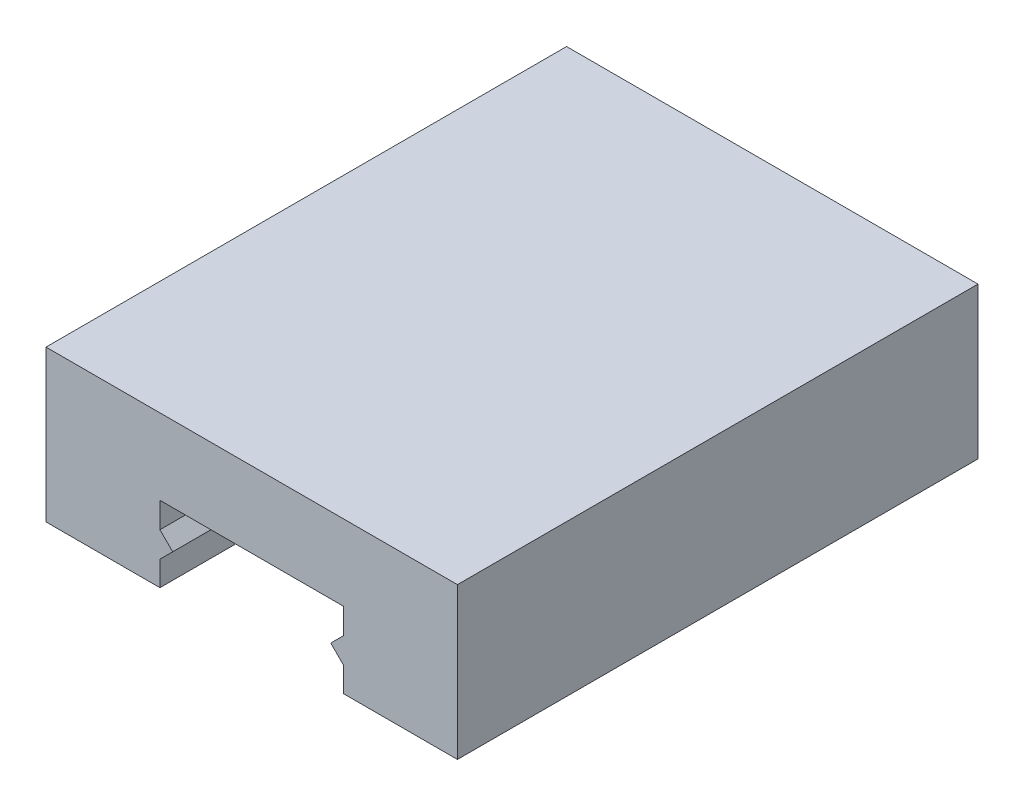
ISO-10303-21;
HEADER;
FILE_DESCRIPTION(('STEP AP214'),'2;1');
FILE_NAME('part.step','',(''),(''),'','','');
FILE_SCHEMA(('AUTOMOTIVE_DESIGN { 1 0 10303 214 1 1 1 1 }'));
ENDSEC;
DATA;
#1=APPLICATION_CONTEXT('core data for automotive mechanical design processes');
#2=APPLICATION_PROTOCOL_DEFINITION('international standard','automotive_design',2000,#1);
#3=PRODUCT_CONTEXT('',#1,'mechanical');
#4=PRODUCT('Part','Part','',(#3));
#5=PRODUCT_RELATED_PRODUCT_CATEGORY('part','',(#4));
#6=PRODUCT_DEFINITION_FORMATION('','',#4);
#7=PRODUCT_DEFINITION_CONTEXT('part definition',#1,'design');
#8=PRODUCT_DEFINITION('design','',#6,#7);
#9=PRODUCT_DEFINITION_SHAPE('','',#8);
#10=(LENGTH_UNIT() NAMED_UNIT(*) SI_UNIT(.MILLI.,.METRE.));
#11=(NAMED_UNIT(*) PLANE_ANGLE_UNIT() SI_UNIT($,.RADIAN.));
#12=(NAMED_UNIT(*) SI_UNIT($,.STERADIAN.) SOLID_ANGLE_UNIT());
#13=UNCERTAINTY_MEASURE_WITH_UNIT(LENGTH_MEASURE(1.E-05),#10,'distance_accuracy_value','');
#14=(GEOMETRIC_REPRESENTATION_CONTEXT(3) GLOBAL_UNCERTAINTY_ASSIGNED_CONTEXT((#13)) GLOBAL_UNIT_ASSIGNED_CONTEXT((#10,
#11,#12)) REPRESENTATION_CONTEXT('',''));
#15=CARTESIAN_POINT('',(0.,0.,0.));
#16=DIRECTION('',(0.,0.,1.));
#17=DIRECTION('',(1.,0.,0.));
#18=AXIS2_PLACEMENT_3D('',#15,#16,#17);
#19=CARTESIAN_POINT('',(-6.,0.05,34.036));
#20=DIRECTION('',(-1.,0.,0.));
#21=DIRECTION('',(0.,0.,1.));
#22=AXIS2_PLACEMENT_3D('',#19,#20,#21);
#23=PLANE('',#22);
#24=DIRECTION('',(0.,1.,0.));
#25=VECTOR('',#24,1.);
#26=CARTESIAN_POINT('',(-6.,0.05,0.));
#27=LINE('',#26,#25);
#28=CARTESIAN_POINT('',(-6.,0.05,0.));
#29=VERTEX_POINT('',#28);
#30=CARTESIAN_POINT('',(-6.,1.66666666666667,0.));
#31=VERTEX_POINT('',#30);
#32=EDGE_CURVE('E205',#29,#31,#27,.T.);
#33=ORIENTED_EDGE('',*,*,#32,.T.);
#34=DIRECTION('',(0.,0.,-1.));
#35=VECTOR('',#34,1.);
#36=CARTESIAN_POINT('',(-6.,1.66666666666667,34.036));
#37=LINE('',#36,#35);
#38=CARTESIAN_POINT('',(-6.,1.66666666666667,34.036));
#39=VERTEX_POINT('',#38);
#40=EDGE_CURVE('E11',#39,#31,#37,.T.);
#41=ORIENTED_EDGE('',*,*,#40,.F.);
#42=DIRECTION('',(0.,1.,0.));
#43=VECTOR('',#42,1.);
#44=CARTESIAN_POINT('',(-6.,0.05,34.036));
#45=LINE('',#44,#43);
#46=CARTESIAN_POINT('',(-6.,0.05,34.036));
#47=VERTEX_POINT('',#46);
#48=EDGE_CURVE('E245',#47,#39,#45,.T.);
#49=ORIENTED_EDGE('',*,*,#48,.F.);
#50=DIRECTION('',(0.,0.,-1.));
#51=VECTOR('',#50,1.);
#52=CARTESIAN_POINT('',(-6.,0.05,34.036));
#53=LINE('',#52,#51);
#54=EDGE_CURVE('E201',#47,#29,#53,.T.);
#55=ORIENTED_EDGE('',*,*,#54,.T.);
#56=EDGE_LOOP('',(#33,#41,#49,#55));
#57=FACE_BOUND('',#56,.T.);
#58=ADVANCED_FACE('F38',(#57),#23,.F.);
#59=CARTESIAN_POINT('',(-6.,1.66666666666667,34.036));
#60=DIRECTION('',(-0.707106781186551,0.707106781186544,0.));
#61=DIRECTION('',(-0.707106781186544,-0.707106781186551,0.));
#62=AXIS2_PLACEMENT_3D('',#59,#60,#61);
#63=PLANE('',#62);
#64=DIRECTION('',(0.707106781186544,0.707106781186551,0.));
#65=VECTOR('',#64,1.);
#66=CARTESIAN_POINT('',(-6.,1.66666666666667,0.));
#67=LINE('',#66,#65);
#68=CARTESIAN_POINT('',(-5.16666666666667,2.5,0.));
#69=VERTEX_POINT('',#68);
#70=EDGE_CURVE('E209',#31,#69,#67,.T.);
#71=ORIENTED_EDGE('',*,*,#70,.T.);
#72=DIRECTION('',(0.,0.,-1.));
#73=VECTOR('',#72,1.);
#74=CARTESIAN_POINT('',(-5.16666666666667,2.5,34.036));
#75=LINE('',#74,#73);
#76=CARTESIAN_POINT('',(-5.16666666666667,2.5,34.036));
#77=VERTEX_POINT('',#76);
#78=EDGE_CURVE('E47',#77,#69,#75,.T.);
#79=ORIENTED_EDGE('',*,*,#78,.F.);
#80=DIRECTION('',(0.707106781186544,0.707106781186551,0.));
#81=VECTOR('',#80,1.);
#82=CARTESIAN_POINT('',(-6.,1.66666666666667,34.036));
#83=LINE('',#82,#81);
#84=EDGE_CURVE('E134',#39,#77,#83,.T.);
#85=ORIENTED_EDGE('',*,*,#84,.F.);
#86=ORIENTED_EDGE('',*,*,#40,.T.);
#87=EDGE_LOOP('',(#71,#79,#85,#86));
#88=FACE_BOUND('',#87,.T.);
#89=ADVANCED_FACE('F351',(#88),#63,.F.);
#90=CARTESIAN_POINT('',(-5.16666666666667,2.5,34.036));
#91=DIRECTION('',(-0.707106781186547,-0.707106781186548,0.));
#92=DIRECTION('',(0.707106781186548,-0.707106781186547,0.));
#93=AXIS2_PLACEMENT_3D('',#90,#91,#92);
#94=PLANE('',#93);
#95=DIRECTION('',(-0.707106781186548,0.707106781186547,0.));
#96=VECTOR('',#95,1.);
#97=CARTESIAN_POINT('',(-5.16666666666667,2.5,0.));
#98=LINE('',#97,#96);
#99=CARTESIAN_POINT('',(-6.,3.33333333333333,0.));
#100=VERTEX_POINT('',#99);
#101=EDGE_CURVE('E212',#69,#100,#98,.T.);
#102=ORIENTED_EDGE('',*,*,#101,.T.);
#103=DIRECTION('',(0.,0.,-1.));
#104=VECTOR('',#103,1.);
#105=CARTESIAN_POINT('',(-6.,3.33333333333333,34.036));
#106=LINE('',#105,#104);
#107=CARTESIAN_POINT('',(-6.,3.33333333333333,34.036));
#108=VERTEX_POINT('',#107);
#109=EDGE_CURVE('E279',#108,#100,#106,.T.);
#110=ORIENTED_EDGE('',*,*,#109,.F.);
#111=DIRECTION('',(-0.707106781186548,0.707106781186547,0.));
#112=VECTOR('',#111,1.);
#113=CARTESIAN_POINT('',(-5.16666666666667,2.5,34.036));
#114=LINE('',#113,#112);
#115=EDGE_CURVE('E288',#77,#108,#114,.T.);
#116=ORIENTED_EDGE('',*,*,#115,.F.);
#117=ORIENTED_EDGE('',*,*,#78,.T.);
#118=EDGE_LOOP('',(#102,#110,#116,#117));
#119=FACE_BOUND('',#118,.T.);
#120=ADVANCED_FACE('F286',(#119),#94,.F.);
#121=CARTESIAN_POINT('',(-6.,3.33333333333333,34.036));
#122=DIRECTION('',(-1.,0.,0.));
#123=DIRECTION('',(0.,0.,1.));
#124=AXIS2_PLACEMENT_3D('',#121,#122,#123);
#125=PLANE('',#124);
#126=DIRECTION('',(0.,1.,0.));
#127=VECTOR('',#126,1.);
#128=CARTESIAN_POINT('',(-6.,3.33333333333333,0.));
#129=LINE('',#128,#127);
#130=CARTESIAN_POINT('',(-6.,5.,0.));
#131=VERTEX_POINT('',#130);
#132=EDGE_CURVE('E215',#100,#131,#129,.T.);
#133=ORIENTED_EDGE('',*,*,#132,.T.);
#134=DIRECTION('',(0.,0.,-1.));
#135=VECTOR('',#134,1.);
#136=CARTESIAN_POINT('',(-6.,5.,34.036));
#137=LINE('',#136,#135);
#138=CARTESIAN_POINT('',(-6.,5.,34.036));
#139=VERTEX_POINT('',#138);
#140=EDGE_CURVE('E275',#139,#131,#137,.T.);
#141=ORIENTED_EDGE('',*,*,#140,.F.);
#142=DIRECTION('',(0.,1.,0.));
#143=VECTOR('',#142,1.);
#144=CARTESIAN_POINT('',(-6.,3.33333333333333,34.036));
#145=LINE('',#144,#143);
#146=EDGE_CURVE('E307',#108,#139,#145,.T.);
#147=ORIENTED_EDGE('',*,*,#146,.F.);
#148=ORIENTED_EDGE('',*,*,#109,.T.);
#149=EDGE_LOOP('',(#133,#141,#147,#148));
#150=FACE_BOUND('',#149,.T.);
#151=ADVANCED_FACE('F297',(#150),#125,.F.);
#152=CARTESIAN_POINT('',(-6.,5.,34.036));
#153=DIRECTION('',(0.,1.,0.));
#154=DIRECTION('',(0.,0.,1.));
#155=AXIS2_PLACEMENT_3D('',#152,#153,#154);
#156=PLANE('',#155);
#157=DIRECTION('',(1.,0.,0.));
#158=VECTOR('',#157,1.);
#159=CARTESIAN_POINT('',(-6.,5.,0.));
#160=LINE('',#159,#158);
#161=CARTESIAN_POINT('',(6.,5.,0.));
#162=VERTEX_POINT('',#161);
#163=EDGE_CURVE('E218',#131,#162,#160,.T.);
#164=ORIENTED_EDGE('',*,*,#163,.T.);
#165=DIRECTION('',(0.,0.,-1.));
#166=VECTOR('',#165,1.);
#167=CARTESIAN_POINT('',(6.,5.,34.036));
#168=LINE('',#167,#166);
#169=CARTESIAN_POINT('',(6.,5.,34.036));
#170=VERTEX_POINT('',#169);
#171=EDGE_CURVE('E271',#170,#162,#168,.T.);
#172=ORIENTED_EDGE('',*,*,#171,.F.);
#173=DIRECTION('',(1.,0.,0.));
#174=VECTOR('',#173,1.);
#175=CARTESIAN_POINT('',(-6.,5.,34.036));
#176=LINE('',#175,#174);
#177=EDGE_CURVE('E303',#139,#170,#176,.T.);
#178=ORIENTED_EDGE('',*,*,#177,.F.);
#179=ORIENTED_EDGE('',*,*,#140,.T.);
#180=EDGE_LOOP('',(#164,#172,#178,#179));
#181=FACE_BOUND('',#180,.T.);
#182=ADVANCED_FACE('F301',(#181),#156,.F.);
#183=CARTESIAN_POINT('',(6.,5.,34.036));
#184=DIRECTION('',(1.,0.,0.));
#185=DIRECTION('',(0.,0.,-1.));
#186=AXIS2_PLACEMENT_3D('',#183,#184,#185);
#187=PLANE('',#186);
#188=DIRECTION('',(0.,-1.,0.));
#189=VECTOR('',#188,1.);
#190=CARTESIAN_POINT('',(6.,5.,0.));
#191=LINE('',#190,#189);
#192=CARTESIAN_POINT('',(6.,3.33333333333333,0.));
#193=VERTEX_POINT('',#192);
#194=EDGE_CURVE('E221',#162,#193,#191,.T.);
#195=ORIENTED_EDGE('',*,*,#194,.T.);
#196=DIRECTION('',(0.,0.,-1.));
#197=VECTOR('',#196,1.);
#198=CARTESIAN_POINT('',(6.,3.33333333333333,34.036));
#199=LINE('',#198,#197);
#200=CARTESIAN_POINT('',(6.,3.33333333333333,34.036));
#201=VERTEX_POINT('',#200);
#202=EDGE_CURVE('E267',#201,#193,#199,.T.);
#203=ORIENTED_EDGE('',*,*,#202,.F.);
#204=DIRECTION('',(0.,-1.,0.));
#205=VECTOR('',#204,1.);
#206=CARTESIAN_POINT('',(6.,5.,34.036));
#207=LINE('',#206,#205);
#208=EDGE_CURVE('E306',#170,#201,#207,.T.);
#209=ORIENTED_EDGE('',*,*,#208,.F.);
#210=ORIENTED_EDGE('',*,*,#171,.T.);
#211=EDGE_LOOP('',(#195,#203,#209,#210));
#212=FACE_BOUND('',#211,.T.);
#213=ADVANCED_FACE('F364',(#212),#187,.F.);
#214=CARTESIAN_POINT('',(6.,3.33333333333333,34.036));
#215=DIRECTION('',(0.707106781186545,-0.70710678118655,0.));
#216=DIRECTION('',(0.70710678118655,0.707106781186545,0.));
#217=AXIS2_PLACEMENT_3D('',#214,#215,#216);
#218=PLANE('',#217);
#219=DIRECTION('',(-0.70710678118655,-0.707106781186545,0.));
#220=VECTOR('',#219,1.);
#221=CARTESIAN_POINT('',(6.,3.33333333333333,0.));
#222=LINE('',#221,#220);
#223=CARTESIAN_POINT('',(5.16666666666667,2.50000000000001,0.));
#224=VERTEX_POINT('',#223);
#225=EDGE_CURVE('E224',#193,#224,#222,.T.);
#226=ORIENTED_EDGE('',*,*,#225,.T.);
#227=DIRECTION('',(0.,0.,-1.));
#228=VECTOR('',#227,1.);
#229=CARTESIAN_POINT('',(5.16666666666667,2.50000000000001,34.036));
#230=LINE('',#229,#228);
#231=CARTESIAN_POINT('',(5.16666666666667,2.50000000000001,34.036));
#232=VERTEX_POINT('',#231);
#233=EDGE_CURVE('E263',#232,#224,#230,.T.);
#234=ORIENTED_EDGE('',*,*,#233,.F.);
#235=DIRECTION('',(-0.70710678118655,-0.707106781186545,0.));
#236=VECTOR('',#235,1.);
#237=CARTESIAN_POINT('',(6.,3.33333333333333,34.036));
#238=LINE('',#237,#236);
#239=EDGE_CURVE('E311',#201,#232,#238,.T.);
#240=ORIENTED_EDGE('',*,*,#239,.F.);
#241=ORIENTED_EDGE('',*,*,#202,.T.);
#242=EDGE_LOOP('',(#226,#234,#240,#241));
#243=FACE_BOUND('',#242,.T.);
#244=ADVANCED_FACE('F367',(#243),#218,.F.);
#245=CARTESIAN_POINT('',(5.16666666666667,2.50000000000001,34.036));
#246=DIRECTION('',(0.70710678118655,0.707106781186545,0.));
#247=DIRECTION('',(-0.707106781186545,0.70710678118655,0.));
#248=AXIS2_PLACEMENT_3D('',#245,#246,#247);
#249=PLANE('',#248);
#250=DIRECTION('',(0.707106781186545,-0.70710678118655,0.));
#251=VECTOR('',#250,1.);
#252=CARTESIAN_POINT('',(5.16666666666667,2.50000000000001,0.));
#253=LINE('',#252,#251);
#254=CARTESIAN_POINT('',(6.,1.66666666666667,0.));
#255=VERTEX_POINT('',#254);
#256=EDGE_CURVE('E227',#224,#255,#253,.T.);
#257=ORIENTED_EDGE('',*,*,#256,.T.);
#258=DIRECTION('',(0.,0.,-1.));
#259=VECTOR('',#258,1.);
#260=CARTESIAN_POINT('',(6.,1.66666666666667,34.036));
#261=LINE('',#260,#259);
#262=CARTESIAN_POINT('',(6.,1.66666666666667,34.036));
#263=VERTEX_POINT('',#262);
#264=EDGE_CURVE('E259',#263,#255,#261,.T.);
#265=ORIENTED_EDGE('',*,*,#264,.F.);
#266=DIRECTION('',(0.707106781186545,-0.70710678118655,0.));
#267=VECTOR('',#266,1.);
#268=CARTESIAN_POINT('',(5.16666666666667,2.50000000000001,34.036));
#269=LINE('',#268,#267);
#270=EDGE_CURVE('E318',#232,#263,#269,.T.);
#271=ORIENTED_EDGE('',*,*,#270,.F.);
#272=ORIENTED_EDGE('',*,*,#233,.T.);
#273=EDGE_LOOP('',(#257,#265,#271,#272));
#274=FACE_BOUND('',#273,.T.);
#275=ADVANCED_FACE('F371',(#274),#249,.F.);
#276=CARTESIAN_POINT('',(6.,1.66666666666667,34.036));
#277=DIRECTION('',(1.,0.,0.));
#278=DIRECTION('',(0.,0.,-1.));
#279=AXIS2_PLACEMENT_3D('',#276,#277,#278);
#280=PLANE('',#279);
#281=DIRECTION('',(0.,-1.,0.));
#282=VECTOR('',#281,1.);
#283=CARTESIAN_POINT('',(6.,1.66666666666667,0.));
#284=LINE('',#283,#282);
#285=CARTESIAN_POINT('',(6.,0.05,0.));
#286=VERTEX_POINT('',#285);
#287=EDGE_CURVE('E230',#255,#286,#284,.T.);
#288=ORIENTED_EDGE('',*,*,#287,.T.);
#289=DIRECTION('',(0.,0.,-1.));
#290=VECTOR('',#289,1.);
#291=CARTESIAN_POINT('',(6.,0.05,34.036));
#292=LINE('',#291,#290);
#293=CARTESIAN_POINT('',(6.,0.05,34.036));
#294=VERTEX_POINT('',#293);
#295=EDGE_CURVE('E255',#294,#286,#292,.T.);
#296=ORIENTED_EDGE('',*,*,#295,.F.);
#297=DIRECTION('',(0.,-1.,0.));
#298=VECTOR('',#297,1.);
#299=CARTESIAN_POINT('',(6.,1.66666666666667,34.036));
#300=LINE('',#299,#298);
#301=EDGE_CURVE('E321',#263,#294,#300,.T.);
#302=ORIENTED_EDGE('',*,*,#301,.F.);
#303=ORIENTED_EDGE('',*,*,#264,.T.);
#304=EDGE_LOOP('',(#288,#296,#302,#303));
#305=FACE_BOUND('',#304,.T.);
#306=ADVANCED_FACE('F375',(#305),#280,.F.);
#307=CARTESIAN_POINT('',(6.,0.05,34.036));
#308=DIRECTION('',(0.,1.,0.));
#309=DIRECTION('',(-1.,0.,0.));
#310=AXIS2_PLACEMENT_3D('',#307,#308,#309);
#311=PLANE('',#310);
#312=DIRECTION('',(1.,0.,0.));
#313=VECTOR('',#312,1.);
#314=CARTESIAN_POINT('',(6.,0.05,0.));
#315=LINE('',#314,#313);
#316=CARTESIAN_POINT('',(13.45,0.05,0.));
#317=VERTEX_POINT('',#316);
#318=EDGE_CURVE('E233',#286,#317,#315,.T.);
#319=ORIENTED_EDGE('',*,*,#318,.T.);
#320=DIRECTION('',(0.,0.,-1.));
#321=VECTOR('',#320,1.);
#322=CARTESIAN_POINT('',(13.45,0.05,34.036));
#323=LINE('',#322,#321);
#324=CARTESIAN_POINT('',(13.45,0.05,34.036));
#325=VERTEX_POINT('',#324);
#326=EDGE_CURVE('E252',#325,#317,#323,.T.);
#327=ORIENTED_EDGE('',*,*,#326,.F.);
#328=DIRECTION('',(1.,0.,0.));
#329=VECTOR('',#328,1.);
#330=CARTESIAN_POINT('',(6.,0.05,34.036));
#331=LINE('',#330,#329);
#332=EDGE_CURVE('E324',#294,#325,#331,.T.);
#333=ORIENTED_EDGE('',*,*,#332,.F.);
#334=ORIENTED_EDGE('',*,*,#295,.T.);
#335=EDGE_LOOP('',(#319,#327,#333,#334));
#336=FACE_BOUND('',#335,.T.);
#337=ADVANCED_FACE('F332',(#336),#311,.F.);
#338=CARTESIAN_POINT('',(13.45,0.05,34.036));
#339=DIRECTION('',(-1.,0.,0.));
#340=DIRECTION('',(0.,0.,1.));
#341=AXIS2_PLACEMENT_3D('',#338,#339,#340);
#342=PLANE('',#341);
#343=DIRECTION('',(0.,1.,0.));
#344=VECTOR('',#343,1.);
#345=CARTESIAN_POINT('',(13.45,0.05,0.));
#346=LINE('',#345,#344);
#347=CARTESIAN_POINT('',(13.45,9.95,0.));
#348=VERTEX_POINT('',#347);
#349=EDGE_CURVE('E236',#317,#348,#346,.T.);
#350=ORIENTED_EDGE('',*,*,#349,.T.);
#351=DIRECTION('',(0.,0.,-1.));
#352=VECTOR('',#351,1.);
#353=CARTESIAN_POINT('',(13.45,9.95,34.036));
#354=LINE('',#353,#352);
#355=CARTESIAN_POINT('',(13.45,9.95,34.036));
#356=VERTEX_POINT('',#355);
#357=EDGE_CURVE('E192',#356,#348,#354,.T.);
#358=ORIENTED_EDGE('',*,*,#357,.F.);
#359=DIRECTION('',(0.,1.,0.));
#360=VECTOR('',#359,1.);
#361=CARTESIAN_POINT('',(13.45,0.05,34.036));
#362=LINE('',#361,#360);
#363=EDGE_CURVE('E181',#325,#356,#362,.T.);
#364=ORIENTED_EDGE('',*,*,#363,.F.);
#365=ORIENTED_EDGE('',*,*,#326,.T.);
#366=EDGE_LOOP('',(#350,#358,#364,#365));
#367=FACE_BOUND('',#366,.T.);
#368=ADVANCED_FACE('F336',(#367),#342,.F.);
#369=CARTESIAN_POINT('',(13.45,9.95,34.036));
#370=DIRECTION('',(0.,-1.,0.));
#371=DIRECTION('',(0.,0.,-1.));
#372=AXIS2_PLACEMENT_3D('',#369,#370,#371);
#373=PLANE('',#372);
#374=DIRECTION('',(-1.,0.,0.));
#375=VECTOR('',#374,1.);
#376=CARTESIAN_POINT('',(13.45,9.95,0.));
#377=LINE('',#376,#375);
#378=CARTESIAN_POINT('',(-13.45,9.95,0.));
#379=VERTEX_POINT('',#378);
#380=EDGE_CURVE('E190',#348,#379,#377,.T.);
#381=ORIENTED_EDGE('',*,*,#380,.T.);
#382=DIRECTION('',(0.,0.,-1.));
#383=VECTOR('',#382,1.);
#384=CARTESIAN_POINT('',(-13.45,9.95,34.036));
#385=LINE('',#384,#383);
#386=CARTESIAN_POINT('',(-13.45,9.95,34.036));
#387=VERTEX_POINT('',#386);
#388=EDGE_CURVE('E187',#387,#379,#385,.T.);
#389=ORIENTED_EDGE('',*,*,#388,.F.);
#390=DIRECTION('',(-1.,0.,0.));
#391=VECTOR('',#390,1.);
#392=CARTESIAN_POINT('',(13.45,9.95,34.036));
#393=LINE('',#392,#391);
#394=EDGE_CURVE('E175',#356,#387,#393,.T.);
#395=ORIENTED_EDGE('',*,*,#394,.F.);
#396=ORIENTED_EDGE('',*,*,#357,.T.);
#397=EDGE_LOOP('',(#381,#389,#395,#396));
#398=FACE_BOUND('',#397,.T.);
#399=ADVANCED_FACE('F188',(#398),#373,.F.);
#400=CARTESIAN_POINT('',(-13.45,9.95,34.036));
#401=DIRECTION('',(1.,0.,0.));
#402=DIRECTION('',(0.,0.,-1.));
#403=AXIS2_PLACEMENT_3D('',#400,#401,#402);
#404=PLANE('',#403);
#405=DIRECTION('',(0.,-1.,0.));
#406=VECTOR('',#405,1.);
#407=CARTESIAN_POINT('',(-13.45,9.95,0.));
#408=LINE('',#407,#406);
#409=CARTESIAN_POINT('',(-13.45,0.05,0.));
#410=VERTEX_POINT('',#409);
#411=EDGE_CURVE('E118',#379,#410,#408,.T.);
#412=ORIENTED_EDGE('',*,*,#411,.T.);
#413=DIRECTION('',(0.,0.,-1.));
#414=VECTOR('',#413,1.);
#415=CARTESIAN_POINT('',(-13.45,0.05,34.036));
#416=LINE('',#415,#414);
#417=CARTESIAN_POINT('',(-13.45,0.05,34.036));
#418=VERTEX_POINT('',#417);
#419=EDGE_CURVE('E193',#418,#410,#416,.T.);
#420=ORIENTED_EDGE('',*,*,#419,.F.);
#421=DIRECTION('',(0.,-1.,0.));
#422=VECTOR('',#421,1.);
#423=CARTESIAN_POINT('',(-13.45,9.95,34.036));
#424=LINE('',#423,#422);
#425=EDGE_CURVE('E179',#387,#418,#424,.T.);
#426=ORIENTED_EDGE('',*,*,#425,.F.);
#427=ORIENTED_EDGE('',*,*,#388,.T.);
#428=EDGE_LOOP('',(#412,#420,#426,#427));
#429=FACE_BOUND('',#428,.T.);
#430=ADVANCED_FACE('F195',(#429),#404,.F.);
#431=CARTESIAN_POINT('',(-13.45,0.05,34.036));
#432=DIRECTION('',(0.,1.,0.));
#433=DIRECTION('',(-1.,0.,0.));
#434=AXIS2_PLACEMENT_3D('',#431,#432,#433);
#435=PLANE('',#434);
#436=DIRECTION('',(1.,0.,0.));
#437=VECTOR('',#436,1.);
#438=CARTESIAN_POINT('',(-13.45,0.05,0.));
#439=LINE('',#438,#437);
#440=EDGE_CURVE('E126',#410,#29,#439,.T.);
#441=ORIENTED_EDGE('',*,*,#440,.T.);
#442=ORIENTED_EDGE('',*,*,#54,.F.);
#443=DIRECTION('',(1.,0.,0.));
#444=VECTOR('',#443,1.);
#445=CARTESIAN_POINT('',(-13.45,0.05,34.036));
#446=LINE('',#445,#444);
#447=EDGE_CURVE('E58',#418,#47,#446,.T.);
#448=ORIENTED_EDGE('',*,*,#447,.F.);
#449=ORIENTED_EDGE('',*,*,#419,.T.);
#450=EDGE_LOOP('',(#441,#442,#448,#449));
#451=FACE_BOUND('',#450,.T.);
#452=ADVANCED_FACE('F340',(#451),#435,.F.);
#453=CARTESIAN_POINT('',(0.,0.,34.036));
#454=DIRECTION('',(0.,0.,-1.));
#455=DIRECTION('',(-1.,0.,0.));
#456=AXIS2_PLACEMENT_3D('',#453,#454,#455);
#457=PLANE('',#456);
#458=ORIENTED_EDGE('',*,*,#48,.T.);
#459=ORIENTED_EDGE('',*,*,#84,.T.);
#460=ORIENTED_EDGE('',*,*,#115,.T.);
#461=ORIENTED_EDGE('',*,*,#146,.T.);
#462=ORIENTED_EDGE('',*,*,#177,.T.);
#463=ORIENTED_EDGE('',*,*,#208,.T.);
#464=ORIENTED_EDGE('',*,*,#239,.T.);
#465=ORIENTED_EDGE('',*,*,#270,.T.);
#466=ORIENTED_EDGE('',*,*,#301,.T.);
#467=ORIENTED_EDGE('',*,*,#332,.T.);
#468=ORIENTED_EDGE('',*,*,#363,.T.);
#469=ORIENTED_EDGE('',*,*,#394,.T.);
#470=ORIENTED_EDGE('',*,*,#425,.T.);
#471=ORIENTED_EDGE('',*,*,#447,.T.);
#472=EDGE_LOOP('',(#458,#459,#460,#461,#462,#463,#464,#465,#466,#467,#468,#469,#470,#471));
#473=FACE_BOUND('',#472,.T.);
#474=ADVANCED_FACE('F177',(#473),#457,.F.);
#475=CARTESIAN_POINT('',(0.,0.,0.));
#476=DIRECTION('',(0.,0.,-1.));
#477=DIRECTION('',(-1.,0.,0.));
#478=AXIS2_PLACEMENT_3D('',#475,#476,#477);
#479=PLANE('',#478);
#480=ORIENTED_EDGE('',*,*,#32,.F.);
#481=ORIENTED_EDGE('',*,*,#440,.F.);
#482=ORIENTED_EDGE('',*,*,#411,.F.);
#483=ORIENTED_EDGE('',*,*,#380,.F.);
#484=ORIENTED_EDGE('',*,*,#349,.F.);
#485=ORIENTED_EDGE('',*,*,#318,.F.);
#486=ORIENTED_EDGE('',*,*,#287,.F.);
#487=ORIENTED_EDGE('',*,*,#256,.F.);
#488=ORIENTED_EDGE('',*,*,#225,.F.);
#489=ORIENTED_EDGE('',*,*,#194,.F.);
#490=ORIENTED_EDGE('',*,*,#163,.F.);
#491=ORIENTED_EDGE('',*,*,#132,.F.);
#492=ORIENTED_EDGE('',*,*,#101,.F.);
#493=ORIENTED_EDGE('',*,*,#70,.F.);
#494=EDGE_LOOP('',(#480,#481,#482,#483,#484,#485,#486,#487,#488,#489,#490,#491,#492,#493));
#495=FACE_BOUND('',#494,.T.);
#496=ADVANCED_FACE('F292',(#495),#479,.T.);
#497=CLOSED_SHELL('',(#58,#89,#120,#151,#182,#213,#244,#275,#306,#337,#368,#399,#430,#452,#474,#496));
#498=MANIFOLD_SOLID_BREP('B2',#497);
#499=ADVANCED_BREP_SHAPE_REPRESENTATION('',(#18,#498),#14);
#500=SHAPE_DEFINITION_REPRESENTATION(#9,#499);
ENDSEC;
END-ISO-10303-21;
